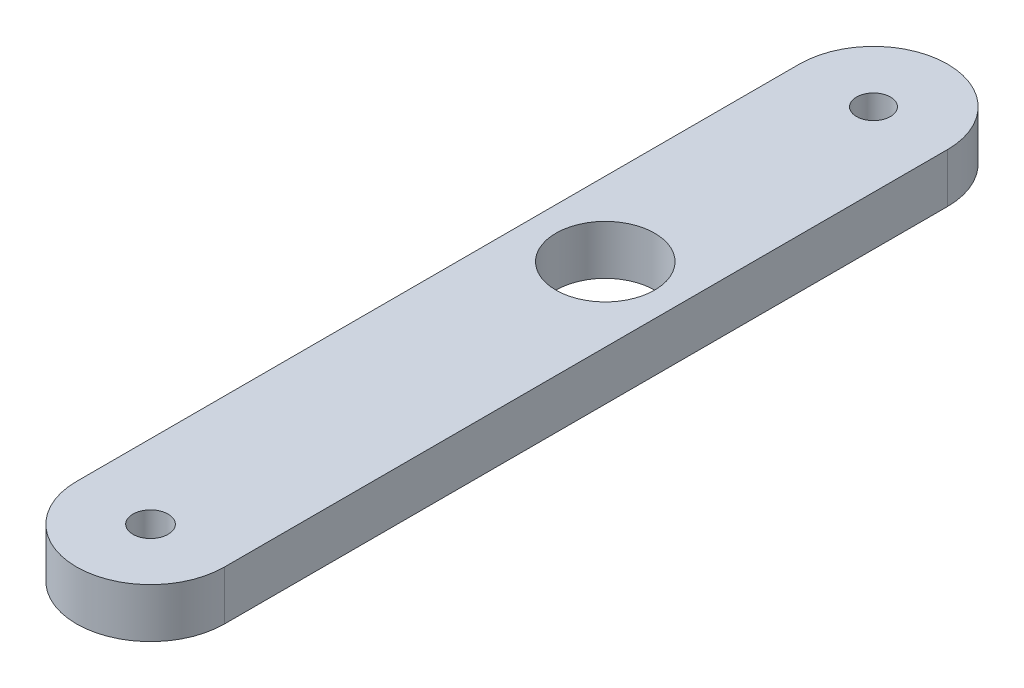
ISO-10303-21;
HEADER;
FILE_DESCRIPTION(('STEP AP214'),'2;1');
FILE_NAME('part.step','',(''),(''),'','','');
FILE_SCHEMA(('AUTOMOTIVE_DESIGN { 1 0 10303 214 1 1 1 1 }'));
ENDSEC;
DATA;
#1=APPLICATION_CONTEXT('core data for automotive mechanical design processes');
#2=APPLICATION_PROTOCOL_DEFINITION('international standard','automotive_design',2000,#1);
#3=PRODUCT_CONTEXT('',#1,'mechanical');
#4=PRODUCT('Part','Part','',(#3));
#5=PRODUCT_RELATED_PRODUCT_CATEGORY('part','',(#4));
#6=PRODUCT_DEFINITION_FORMATION('','',#4);
#7=PRODUCT_DEFINITION_CONTEXT('part definition',#1,'design');
#8=PRODUCT_DEFINITION('design','',#6,#7);
#9=PRODUCT_DEFINITION_SHAPE('','',#8);
#10=(LENGTH_UNIT() NAMED_UNIT(*) SI_UNIT(.MILLI.,.METRE.));
#11=(NAMED_UNIT(*) PLANE_ANGLE_UNIT() SI_UNIT($,.RADIAN.));
#12=(NAMED_UNIT(*) SI_UNIT($,.STERADIAN.) SOLID_ANGLE_UNIT());
#13=UNCERTAINTY_MEASURE_WITH_UNIT(LENGTH_MEASURE(1.E-05),#10,'distance_accuracy_value','');
#14=(GEOMETRIC_REPRESENTATION_CONTEXT(3) GLOBAL_UNCERTAINTY_ASSIGNED_CONTEXT((#13)) GLOBAL_UNIT_ASSIGNED_CONTEXT((#10,
#11,#12)) REPRESENTATION_CONTEXT('',''));
#15=CARTESIAN_POINT('',(0.,0.,0.));
#16=DIRECTION('',(0.,0.,1.));
#17=DIRECTION('',(1.,0.,0.));
#18=AXIS2_PLACEMENT_3D('',#15,#16,#17);
#19=CARTESIAN_POINT('',(-11.4692112028249,3.175,-20.0432845878054));
#20=DIRECTION('',(0.,1.,0.));
#21=DIRECTION('',(0.,0.,1.));
#22=AXIS2_PLACEMENT_3D('',#19,#20,#21);
#23=PLANE('',#22);
#24=CARTESIAN_POINT('',(-11.4692112028249,3.175,-2.7932845878054));
#25=DIRECTION('',(0.,1.,0.));
#26=DIRECTION('',(0.,0.,1.));
#27=AXIS2_PLACEMENT_3D('',#24,#25,#26);
#28=CIRCLE('',#27,3.175);
#29=CARTESIAN_POINT('',(-11.4692112028249,3.175,0.381715412194603));
#30=VERTEX_POINT('',#29);
#31=EDGE_CURVE('E113',#30,#30,#28,.T.);
#32=ORIENTED_EDGE('',*,*,#31,.F.);
#33=EDGE_LOOP('',(#32));
#34=FACE_BOUND('',#33,.T.);
#35=CARTESIAN_POINT('',(-11.4692112028249,3.175,-20.0432845878054));
#36=DIRECTION('',(0.,1.,0.));
#37=DIRECTION('',(0.,0.,1.));
#38=AXIS2_PLACEMENT_3D('',#35,#36,#37);
#39=CIRCLE('',#38,4.7625);
#40=CARTESIAN_POINT('',(-6.70671120282487,3.175,-20.0432845878054));
#41=VERTEX_POINT('',#40);
#42=CARTESIAN_POINT('',(-16.2317112028249,3.175,-20.0432845878054));
#43=VERTEX_POINT('',#42);
#44=EDGE_CURVE('E84',#41,#43,#39,.T.);
#45=ORIENTED_EDGE('',*,*,#44,.T.);
#46=DIRECTION('',(0.,0.,1.));
#47=VECTOR('',#46,1.);
#48=CARTESIAN_POINT('',(-16.2317112028249,3.175,-20.0432845878054));
#49=LINE('',#48,#47);
#50=CARTESIAN_POINT('',(-16.2317112028249,3.175,26.4567154121946));
#51=VERTEX_POINT('',#50);
#52=EDGE_CURVE('E78',#43,#51,#49,.T.);
#53=ORIENTED_EDGE('',*,*,#52,.T.);
#54=CARTESIAN_POINT('',(-11.4692112028249,3.175,26.4567154121946));
#55=DIRECTION('',(0.,1.,0.));
#56=DIRECTION('',(0.,0.,1.));
#57=AXIS2_PLACEMENT_3D('',#54,#55,#56);
#58=CIRCLE('',#57,4.7625);
#59=CARTESIAN_POINT('',(-6.70671120282486,3.175,26.4567154121946));
#60=VERTEX_POINT('',#59);
#61=EDGE_CURVE('E81',#51,#60,#58,.T.);
#62=ORIENTED_EDGE('',*,*,#61,.T.);
#63=DIRECTION('',(0.,0.,-1.));
#64=VECTOR('',#63,1.);
#65=CARTESIAN_POINT('',(-6.70671120282486,3.175,26.4567154121946));
#66=LINE('',#65,#64);
#67=EDGE_CURVE('E50',#60,#41,#66,.T.);
#68=ORIENTED_EDGE('',*,*,#67,.T.);
#69=EDGE_LOOP('',(#45,#53,#62,#68));
#70=FACE_BOUND('',#69,.T.);
#71=CARTESIAN_POINT('',(-11.4692112028249,3.175,-20.0432845878054));
#72=DIRECTION('',(0.,1.,0.));
#73=DIRECTION('',(0.,0.,1.));
#74=AXIS2_PLACEMENT_3D('',#71,#72,#73);
#75=CIRCLE('',#74,1.0922);
#76=CARTESIAN_POINT('',(-11.4692112028249,3.175,-18.9510845878054));
#77=VERTEX_POINT('',#76);
#78=EDGE_CURVE('E101',#77,#77,#75,.T.);
#79=ORIENTED_EDGE('',*,*,#78,.F.);
#80=EDGE_LOOP('',(#79));
#81=FACE_BOUND('',#80,.T.);
#82=CARTESIAN_POINT('',(-11.4692112028249,3.175,26.4567154121946));
#83=DIRECTION('',(0.,1.,0.));
#84=DIRECTION('',(0.,0.,1.));
#85=AXIS2_PLACEMENT_3D('',#82,#83,#84);
#86=CIRCLE('',#85,1.1303);
#87=CARTESIAN_POINT('',(-11.4692112028249,3.175,27.5870154121946));
#88=VERTEX_POINT('',#87);
#89=EDGE_CURVE('E119',#88,#88,#86,.T.);
#90=ORIENTED_EDGE('',*,*,#89,.F.);
#91=EDGE_LOOP('',(#90));
#92=FACE_BOUND('',#91,.T.);
#93=ADVANCED_FACE('F33',(#34,#70,#81,#92),#23,.T.);
#94=CARTESIAN_POINT('',(-11.4692112028249,0.,-20.0432845878054));
#95=DIRECTION('',(0.,1.,0.));
#96=DIRECTION('',(0.,0.,1.));
#97=AXIS2_PLACEMENT_3D('',#94,#95,#96);
#98=PLANE('',#97);
#99=CARTESIAN_POINT('',(-11.4692112028249,0.,-2.7932845878054));
#100=DIRECTION('',(0.,1.,0.));
#101=DIRECTION('',(0.,0.,1.));
#102=AXIS2_PLACEMENT_3D('',#99,#100,#101);
#103=CIRCLE('',#102,3.175);
#104=CARTESIAN_POINT('',(-11.4692112028249,0.,0.381715412194603));
#105=VERTEX_POINT('',#104);
#106=EDGE_CURVE('E116',#105,#105,#103,.T.);
#107=ORIENTED_EDGE('',*,*,#106,.T.);
#108=EDGE_LOOP('',(#107));
#109=FACE_BOUND('',#108,.T.);
#110=CARTESIAN_POINT('',(-11.4692112028249,0.,-20.0432845878054));
#111=DIRECTION('',(0.,1.,0.));
#112=DIRECTION('',(0.,0.,1.));
#113=AXIS2_PLACEMENT_3D('',#110,#111,#112);
#114=CIRCLE('',#113,4.7625);
#115=CARTESIAN_POINT('',(-6.70671120282487,0.,-20.0432845878054));
#116=VERTEX_POINT('',#115);
#117=CARTESIAN_POINT('',(-16.2317112028249,0.,-20.0432845878054));
#118=VERTEX_POINT('',#117);
#119=EDGE_CURVE('E98',#116,#118,#114,.T.);
#120=ORIENTED_EDGE('',*,*,#119,.F.);
#121=DIRECTION('',(0.,0.,-1.));
#122=VECTOR('',#121,1.);
#123=CARTESIAN_POINT('',(-6.70671120282487,0.,-20.0432845878054));
#124=LINE('',#123,#122);
#125=CARTESIAN_POINT('',(-6.70671120282486,0.,26.4567154121946));
#126=VERTEX_POINT('',#125);
#127=EDGE_CURVE('E67',#126,#116,#124,.T.);
#128=ORIENTED_EDGE('',*,*,#127,.F.);
#129=CARTESIAN_POINT('',(-11.4692112028249,0.,26.4567154121946));
#130=DIRECTION('',(0.,1.,0.));
#131=DIRECTION('',(0.,0.,1.));
#132=AXIS2_PLACEMENT_3D('',#129,#130,#131);
#133=CIRCLE('',#132,4.7625);
#134=CARTESIAN_POINT('',(-16.2317112028249,0.,26.4567154121946));
#135=VERTEX_POINT('',#134);
#136=EDGE_CURVE('E103',#135,#126,#133,.T.);
#137=ORIENTED_EDGE('',*,*,#136,.F.);
#138=DIRECTION('',(0.,0.,1.));
#139=VECTOR('',#138,1.);
#140=CARTESIAN_POINT('',(-16.2317112028249,0.,26.4567154121946));
#141=LINE('',#140,#139);
#142=EDGE_CURVE('E89',#118,#135,#141,.T.);
#143=ORIENTED_EDGE('',*,*,#142,.F.);
#144=EDGE_LOOP('',(#120,#128,#137,#143));
#145=FACE_BOUND('',#144,.T.);
#146=CARTESIAN_POINT('',(-11.4692112028249,0.,-20.0432845878054));
#147=DIRECTION('',(0.,1.,0.));
#148=DIRECTION('',(0.,0.,1.));
#149=AXIS2_PLACEMENT_3D('',#146,#147,#148);
#150=CIRCLE('',#149,1.0922);
#151=CARTESIAN_POINT('',(-11.4692112028249,0.,-18.9510845878054));
#152=VERTEX_POINT('',#151);
#153=EDGE_CURVE('E110',#152,#152,#150,.T.);
#154=ORIENTED_EDGE('',*,*,#153,.T.);
#155=EDGE_LOOP('',(#154));
#156=FACE_BOUND('',#155,.T.);
#157=CARTESIAN_POINT('',(-11.4692112028249,0.,26.4567154121946));
#158=DIRECTION('',(0.,1.,0.));
#159=DIRECTION('',(0.,0.,1.));
#160=AXIS2_PLACEMENT_3D('',#157,#158,#159);
#161=CIRCLE('',#160,1.1303);
#162=CARTESIAN_POINT('',(-11.4692112028249,0.,27.5870154121946));
#163=VERTEX_POINT('',#162);
#164=EDGE_CURVE('E122',#163,#163,#161,.T.);
#165=ORIENTED_EDGE('',*,*,#164,.T.);
#166=EDGE_LOOP('',(#165));
#167=FACE_BOUND('',#166,.T.);
#168=ADVANCED_FACE('F132',(#109,#145,#156,#167),#98,.F.);
#169=CARTESIAN_POINT('',(-11.4692112028249,3.175,-20.0432845878054));
#170=DIRECTION('',(0.,-1.,0.));
#171=DIRECTION('',(0.,0.,-1.));
#172=AXIS2_PLACEMENT_3D('',#169,#170,#171);
#173=CYLINDRICAL_SURFACE('',#172,4.7625);
#174=ORIENTED_EDGE('',*,*,#119,.T.);
#175=DIRECTION('',(0.,-1.,0.));
#176=VECTOR('',#175,1.);
#177=CARTESIAN_POINT('',(-16.2317112028249,3.175,-20.0432845878054));
#178=LINE('',#177,#176);
#179=EDGE_CURVE('E11',#43,#118,#178,.T.);
#180=ORIENTED_EDGE('',*,*,#179,.F.);
#181=ORIENTED_EDGE('',*,*,#44,.F.);
#182=DIRECTION('',(0.,-1.,0.));
#183=VECTOR('',#182,1.);
#184=CARTESIAN_POINT('',(-6.70671120282487,3.175,-20.0432845878054));
#185=LINE('',#184,#183);
#186=EDGE_CURVE('E94',#41,#116,#185,.T.);
#187=ORIENTED_EDGE('',*,*,#186,.T.);
#188=EDGE_LOOP('',(#174,#180,#181,#187));
#189=FACE_BOUND('',#188,.T.);
#190=ADVANCED_FACE('F35',(#189),#173,.T.);
#191=CARTESIAN_POINT('',(-16.2317112028249,3.175,26.4567154121946));
#192=DIRECTION('',(1.,0.,0.));
#193=DIRECTION('',(0.,0.,-1.));
#194=AXIS2_PLACEMENT_3D('',#191,#192,#193);
#195=PLANE('',#194);
#196=ORIENTED_EDGE('',*,*,#142,.T.);
#197=DIRECTION('',(0.,-1.,0.));
#198=VECTOR('',#197,1.);
#199=CARTESIAN_POINT('',(-16.2317112028249,3.175,26.4567154121946));
#200=LINE('',#199,#198);
#201=EDGE_CURVE('E42',#51,#135,#200,.T.);
#202=ORIENTED_EDGE('',*,*,#201,.F.);
#203=ORIENTED_EDGE('',*,*,#52,.F.);
#204=ORIENTED_EDGE('',*,*,#179,.T.);
#205=EDGE_LOOP('',(#196,#202,#203,#204));
#206=FACE_BOUND('',#205,.T.);
#207=ADVANCED_FACE('F88',(#206),#195,.F.);
#208=CARTESIAN_POINT('',(-11.4692112028249,3.175,26.4567154121946));
#209=DIRECTION('',(0.,-1.,0.));
#210=DIRECTION('',(0.,0.,-1.));
#211=AXIS2_PLACEMENT_3D('',#208,#209,#210);
#212=CYLINDRICAL_SURFACE('',#211,4.7625);
#213=ORIENTED_EDGE('',*,*,#136,.T.);
#214=DIRECTION('',(0.,-1.,0.));
#215=VECTOR('',#214,1.);
#216=CARTESIAN_POINT('',(-6.70671120282486,3.175,26.4567154121946));
#217=LINE('',#216,#215);
#218=EDGE_CURVE('E91',#60,#126,#217,.T.);
#219=ORIENTED_EDGE('',*,*,#218,.F.);
#220=ORIENTED_EDGE('',*,*,#61,.F.);
#221=ORIENTED_EDGE('',*,*,#201,.T.);
#222=EDGE_LOOP('',(#213,#219,#220,#221));
#223=FACE_BOUND('',#222,.T.);
#224=ADVANCED_FACE('F92',(#223),#212,.T.);
#225=CARTESIAN_POINT('',(-6.70671120282487,3.175,-20.0432845878054));
#226=DIRECTION('',(-1.,0.,0.));
#227=DIRECTION('',(0.,0.,1.));
#228=AXIS2_PLACEMENT_3D('',#225,#226,#227);
#229=PLANE('',#228);
#230=ORIENTED_EDGE('',*,*,#127,.T.);
#231=ORIENTED_EDGE('',*,*,#186,.F.);
#232=ORIENTED_EDGE('',*,*,#67,.F.);
#233=ORIENTED_EDGE('',*,*,#218,.T.);
#234=EDGE_LOOP('',(#230,#231,#232,#233));
#235=FACE_BOUND('',#234,.T.);
#236=ADVANCED_FACE('F107',(#235),#229,.F.);
#237=CARTESIAN_POINT('',(-11.4692112028249,3.175,-20.0432845878054));
#238=DIRECTION('',(0.,-1.,0.));
#239=DIRECTION('',(0.,0.,-1.));
#240=AXIS2_PLACEMENT_3D('',#237,#238,#239);
#241=CYLINDRICAL_SURFACE('',#240,1.0922);
#242=ORIENTED_EDGE('',*,*,#78,.T.);
#243=EDGE_LOOP('',(#242));
#244=FACE_BOUND('',#243,.T.);
#245=ORIENTED_EDGE('',*,*,#153,.F.);
#246=EDGE_LOOP('',(#245));
#247=FACE_BOUND('',#246,.T.);
#248=ADVANCED_FACE('F142',(#244,#247),#241,.F.);
#249=CARTESIAN_POINT('',(-11.4692112028249,3.175,-2.7932845878054));
#250=DIRECTION('',(0.,-1.,0.));
#251=DIRECTION('',(0.,0.,-1.));
#252=AXIS2_PLACEMENT_3D('',#249,#250,#251);
#253=CYLINDRICAL_SURFACE('',#252,3.175);
#254=ORIENTED_EDGE('',*,*,#31,.T.);
#255=EDGE_LOOP('',(#254));
#256=FACE_BOUND('',#255,.T.);
#257=ORIENTED_EDGE('',*,*,#106,.F.);
#258=EDGE_LOOP('',(#257));
#259=FACE_BOUND('',#258,.T.);
#260=ADVANCED_FACE('F194',(#256,#259),#253,.F.);
#261=CARTESIAN_POINT('',(-11.4692112028249,3.175,26.4567154121946));
#262=DIRECTION('',(0.,-1.,0.));
#263=DIRECTION('',(0.,0.,-1.));
#264=AXIS2_PLACEMENT_3D('',#261,#262,#263);
#265=CYLINDRICAL_SURFACE('',#264,1.1303);
#266=ORIENTED_EDGE('',*,*,#89,.T.);
#267=EDGE_LOOP('',(#266));
#268=FACE_BOUND('',#267,.T.);
#269=ORIENTED_EDGE('',*,*,#164,.F.);
#270=EDGE_LOOP('',(#269));
#271=FACE_BOUND('',#270,.T.);
#272=ADVANCED_FACE('F128',(#268,#271),#265,.F.);
#273=CLOSED_SHELL('',(#93,#168,#190,#207,#224,#236,#248,#260,#272));
#274=MANIFOLD_SOLID_BREP('B2',#273);
#275=ADVANCED_BREP_SHAPE_REPRESENTATION('',(#18,#274),#14);
#276=SHAPE_DEFINITION_REPRESENTATION(#9,#275);
ENDSEC;
END-ISO-10303-21;
